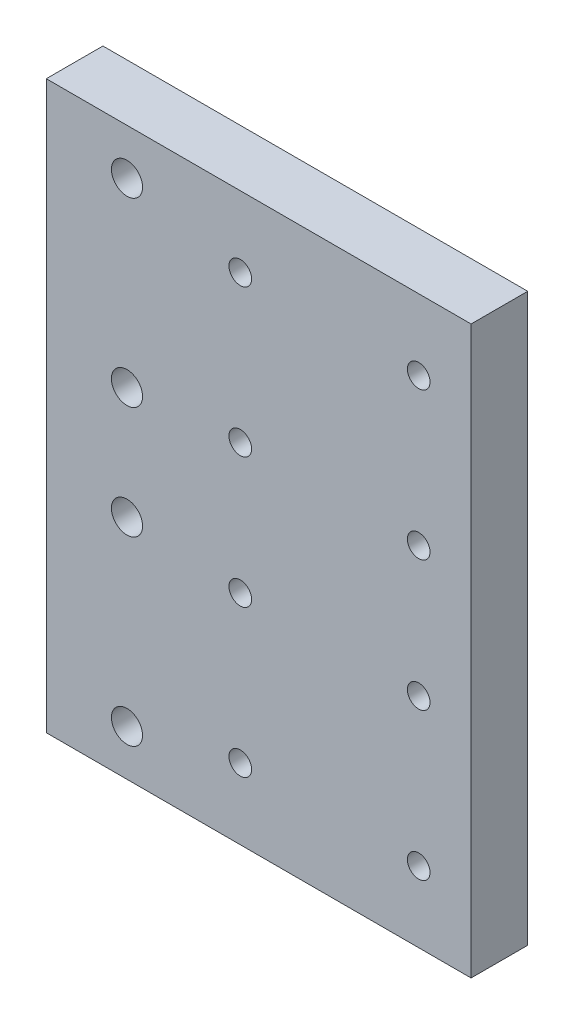
ISO-10303-21;
HEADER;
FILE_DESCRIPTION(('STEP AP214'),'2;1');
FILE_NAME('part.step','',(''),(''),'','','');
FILE_SCHEMA(('AUTOMOTIVE_DESIGN { 1 0 10303 214 1 1 1 1 }'));
ENDSEC;
DATA;
#1=APPLICATION_CONTEXT('core data for automotive mechanical design processes');
#2=APPLICATION_PROTOCOL_DEFINITION('international standard','automotive_design',2000,#1);
#3=PRODUCT_CONTEXT('',#1,'mechanical');
#4=PRODUCT('Part','Part','',(#3));
#5=PRODUCT_RELATED_PRODUCT_CATEGORY('part','',(#4));
#6=PRODUCT_DEFINITION_FORMATION('','',#4);
#7=PRODUCT_DEFINITION_CONTEXT('part definition',#1,'design');
#8=PRODUCT_DEFINITION('design','',#6,#7);
#9=PRODUCT_DEFINITION_SHAPE('','',#8);
#10=(LENGTH_UNIT() NAMED_UNIT(*) SI_UNIT(.MILLI.,.METRE.));
#11=(NAMED_UNIT(*) PLANE_ANGLE_UNIT() SI_UNIT($,.RADIAN.));
#12=(NAMED_UNIT(*) SI_UNIT($,.STERADIAN.) SOLID_ANGLE_UNIT());
#13=UNCERTAINTY_MEASURE_WITH_UNIT(LENGTH_MEASURE(1.E-05),#10,'distance_accuracy_value','');
#14=(GEOMETRIC_REPRESENTATION_CONTEXT(3) GLOBAL_UNCERTAINTY_ASSIGNED_CONTEXT((#13)) GLOBAL_UNIT_ASSIGNED_CONTEXT((#10,
#11,#12)) REPRESENTATION_CONTEXT('',''));
#15=CARTESIAN_POINT('',(0.,0.,0.));
#16=DIRECTION('',(0.,0.,1.));
#17=DIRECTION('',(1.,0.,0.));
#18=AXIS2_PLACEMENT_3D('',#15,#16,#17);
#19=CARTESIAN_POINT('',(0.,0.,10.));
#20=DIRECTION('',(0.,0.,1.));
#21=DIRECTION('',(1.,0.,0.));
#22=AXIS2_PLACEMENT_3D('',#19,#20,#21);
#23=PLANE('',#22);
#24=CARTESIAN_POINT('',(-60.75,-9.9046319920955,10.));
#25=DIRECTION('',(0.,0.,1.));
#26=DIRECTION('',(1.,0.,0.));
#27=AXIS2_PLACEMENT_3D('',#24,#25,#26);
#28=CIRCLE('',#27,2.75000000000001);
#29=CARTESIAN_POINT('',(-58.,-9.9046319920955,10.));
#30=VERTEX_POINT('',#29);
#31=EDGE_CURVE('E169',#30,#30,#28,.T.);
#32=ORIENTED_EDGE('',*,*,#31,.F.);
#33=EDGE_LOOP('',(#32));
#34=FACE_BOUND('',#33,.T.);
#35=CARTESIAN_POINT('',(-60.75,41.9046319920955,10.));
#36=DIRECTION('',(0.,0.,1.));
#37=DIRECTION('',(1.,0.,0.));
#38=AXIS2_PLACEMENT_3D('',#35,#36,#37);
#39=CIRCLE('',#38,2.75000000000001);
#40=CARTESIAN_POINT('',(-58.,41.9046319920955,10.));
#41=VERTEX_POINT('',#40);
#42=EDGE_CURVE('E157',#41,#41,#39,.T.);
#43=ORIENTED_EDGE('',*,*,#42,.F.);
#44=EDGE_LOOP('',(#43));
#45=FACE_BOUND('',#44,.T.);
#46=CARTESIAN_POINT('',(-9.25000000000001,-37.5,10.));
#47=DIRECTION('',(0.,0.,1.));
#48=DIRECTION('',(1.,0.,0.));
#49=AXIS2_PLACEMENT_3D('',#46,#47,#48);
#50=CIRCLE('',#49,2.);
#51=CARTESIAN_POINT('',(-7.25,-37.5,10.));
#52=VERTEX_POINT('',#51);
#53=EDGE_CURVE('E145',#52,#52,#50,.T.);
#54=ORIENTED_EDGE('',*,*,#53,.F.);
#55=EDGE_LOOP('',(#54));
#56=FACE_BOUND('',#55,.T.);
#57=CARTESIAN_POINT('',(-40.75,-11.5,10.));
#58=DIRECTION('',(0.,0.,1.));
#59=DIRECTION('',(1.,0.,0.));
#60=AXIS2_PLACEMENT_3D('',#57,#58,#59);
#61=CIRCLE('',#60,2.);
#62=CARTESIAN_POINT('',(-38.75,-11.5,10.));
#63=VERTEX_POINT('',#62);
#64=EDGE_CURVE('E133',#63,#63,#61,.T.);
#65=ORIENTED_EDGE('',*,*,#64,.F.);
#66=EDGE_LOOP('',(#65));
#67=FACE_BOUND('',#66,.T.);
#68=CARTESIAN_POINT('',(-40.75,11.5,10.));
#69=DIRECTION('',(0.,0.,1.));
#70=DIRECTION('',(1.,0.,0.));
#71=AXIS2_PLACEMENT_3D('',#68,#69,#70);
#72=CIRCLE('',#71,2.);
#73=CARTESIAN_POINT('',(-38.75,11.5,10.));
#74=VERTEX_POINT('',#73);
#75=EDGE_CURVE('E121',#74,#74,#72,.T.);
#76=ORIENTED_EDGE('',*,*,#75,.F.);
#77=EDGE_LOOP('',(#76));
#78=FACE_BOUND('',#77,.T.);
#79=CARTESIAN_POINT('',(-40.75,37.5,10.));
#80=DIRECTION('',(0.,0.,1.));
#81=DIRECTION('',(1.,0.,0.));
#82=AXIS2_PLACEMENT_3D('',#79,#80,#81);
#83=CIRCLE('',#82,2.);
#84=CARTESIAN_POINT('',(-38.75,37.5,10.));
#85=VERTEX_POINT('',#84);
#86=EDGE_CURVE('E100',#85,#85,#83,.T.);
#87=ORIENTED_EDGE('',*,*,#86,.F.);
#88=EDGE_LOOP('',(#87));
#89=FACE_BOUND('',#88,.T.);
#90=DIRECTION('',(-1.,0.,0.));
#91=VECTOR('',#90,1.);
#92=CARTESIAN_POINT('',(0.,50.,10.));
#93=LINE('',#92,#91);
#94=CARTESIAN_POINT('',(0.,50.,10.));
#95=VERTEX_POINT('',#94);
#96=CARTESIAN_POINT('',(-75.,50.,10.));
#97=VERTEX_POINT('',#96);
#98=EDGE_CURVE('E85',#95,#97,#93,.T.);
#99=ORIENTED_EDGE('',*,*,#98,.T.);
#100=DIRECTION('',(0.,-1.,0.));
#101=VECTOR('',#100,1.);
#102=CARTESIAN_POINT('',(-75.,50.,10.));
#103=LINE('',#102,#101);
#104=CARTESIAN_POINT('',(-75.,-50.,10.));
#105=VERTEX_POINT('',#104);
#106=EDGE_CURVE('E80',#97,#105,#103,.T.);
#107=ORIENTED_EDGE('',*,*,#106,.T.);
#108=DIRECTION('',(1.,0.,0.));
#109=VECTOR('',#108,1.);
#110=CARTESIAN_POINT('',(-75.,-50.,10.));
#111=LINE('',#110,#109);
#112=CARTESIAN_POINT('',(0.,-50.,10.));
#113=VERTEX_POINT('',#112);
#114=EDGE_CURVE('E83',#105,#113,#111,.T.);
#115=ORIENTED_EDGE('',*,*,#114,.T.);
#116=DIRECTION('',(0.,1.,0.));
#117=VECTOR('',#116,1.);
#118=CARTESIAN_POINT('',(0.,-50.,10.));
#119=LINE('',#118,#117);
#120=EDGE_CURVE('E50',#113,#95,#119,.T.);
#121=ORIENTED_EDGE('',*,*,#120,.T.);
#122=EDGE_LOOP('',(#99,#107,#115,#121));
#123=FACE_BOUND('',#122,.T.);
#124=CARTESIAN_POINT('',(-9.25000000000001,37.5,10.));
#125=DIRECTION('',(0.,0.,1.));
#126=DIRECTION('',(1.,0.,0.));
#127=AXIS2_PLACEMENT_3D('',#124,#125,#126);
#128=CIRCLE('',#127,2.);
#129=CARTESIAN_POINT('',(-7.25,37.5,10.));
#130=VERTEX_POINT('',#129);
#131=EDGE_CURVE('E115',#130,#130,#128,.T.);
#132=ORIENTED_EDGE('',*,*,#131,.F.);
#133=EDGE_LOOP('',(#132));
#134=FACE_BOUND('',#133,.T.);
#135=CARTESIAN_POINT('',(-9.25000000000001,11.5,10.));
#136=DIRECTION('',(0.,0.,1.));
#137=DIRECTION('',(1.,0.,0.));
#138=AXIS2_PLACEMENT_3D('',#135,#136,#137);
#139=CIRCLE('',#138,2.);
#140=CARTESIAN_POINT('',(-7.25000000000001,11.5,10.));
#141=VERTEX_POINT('',#140);
#142=EDGE_CURVE('E127',#141,#141,#139,.T.);
#143=ORIENTED_EDGE('',*,*,#142,.F.);
#144=EDGE_LOOP('',(#143));
#145=FACE_BOUND('',#144,.T.);
#146=CARTESIAN_POINT('',(-9.25000000000001,-11.5,10.));
#147=DIRECTION('',(0.,0.,1.));
#148=DIRECTION('',(1.,0.,0.));
#149=AXIS2_PLACEMENT_3D('',#146,#147,#148);
#150=CIRCLE('',#149,2.);
#151=CARTESIAN_POINT('',(-7.25,-11.5,10.));
#152=VERTEX_POINT('',#151);
#153=EDGE_CURVE('E139',#152,#152,#150,.T.);
#154=ORIENTED_EDGE('',*,*,#153,.F.);
#155=EDGE_LOOP('',(#154));
#156=FACE_BOUND('',#155,.T.);
#157=CARTESIAN_POINT('',(-40.75,-37.5,10.));
#158=DIRECTION('',(0.,0.,1.));
#159=DIRECTION('',(1.,0.,0.));
#160=AXIS2_PLACEMENT_3D('',#157,#158,#159);
#161=CIRCLE('',#160,2.);
#162=CARTESIAN_POINT('',(-38.75,-37.5,10.));
#163=VERTEX_POINT('',#162);
#164=EDGE_CURVE('E151',#163,#163,#161,.T.);
#165=ORIENTED_EDGE('',*,*,#164,.F.);
#166=EDGE_LOOP('',(#165));
#167=FACE_BOUND('',#166,.T.);
#168=CARTESIAN_POINT('',(-60.75,9.9046319920955,10.));
#169=DIRECTION('',(0.,0.,1.));
#170=DIRECTION('',(1.,0.,0.));
#171=AXIS2_PLACEMENT_3D('',#168,#169,#170);
#172=CIRCLE('',#171,2.75000000000001);
#173=CARTESIAN_POINT('',(-58.,9.9046319920955,10.));
#174=VERTEX_POINT('',#173);
#175=EDGE_CURVE('E163',#174,#174,#172,.T.);
#176=ORIENTED_EDGE('',*,*,#175,.F.);
#177=EDGE_LOOP('',(#176));
#178=FACE_BOUND('',#177,.T.);
#179=CARTESIAN_POINT('',(-60.75,-41.9046319920955,10.));
#180=DIRECTION('',(0.,0.,1.));
#181=DIRECTION('',(1.,0.,0.));
#182=AXIS2_PLACEMENT_3D('',#179,#180,#181);
#183=CIRCLE('',#182,2.75000000000001);
#184=CARTESIAN_POINT('',(-58.,-41.9046319920955,10.));
#185=VERTEX_POINT('',#184);
#186=EDGE_CURVE('E175',#185,#185,#183,.T.);
#187=ORIENTED_EDGE('',*,*,#186,.F.);
#188=EDGE_LOOP('',(#187));
#189=FACE_BOUND('',#188,.T.);
#190=ADVANCED_FACE('F33',(#34,#45,#56,#67,#78,#89,#123,#134,#145,#156,#167,#178,#189),#23,.T.);
#191=CARTESIAN_POINT('',(0.,0.,0.));
#192=DIRECTION('',(0.,0.,1.));
#193=DIRECTION('',(1.,0.,0.));
#194=AXIS2_PLACEMENT_3D('',#191,#192,#193);
#195=PLANE('',#194);
#196=DIRECTION('',(-1.,0.,0.));
#197=VECTOR('',#196,1.);
#198=CARTESIAN_POINT('',(0.,50.,0.));
#199=LINE('',#198,#197);
#200=CARTESIAN_POINT('',(0.,50.,0.));
#201=VERTEX_POINT('',#200);
#202=CARTESIAN_POINT('',(-75.,50.,0.));
#203=VERTEX_POINT('',#202);
#204=EDGE_CURVE('E97',#201,#203,#199,.T.);
#205=ORIENTED_EDGE('',*,*,#204,.F.);
#206=DIRECTION('',(0.,1.,0.));
#207=VECTOR('',#206,1.);
#208=CARTESIAN_POINT('',(0.,-50.,0.));
#209=LINE('',#208,#207);
#210=CARTESIAN_POINT('',(0.,-50.,0.));
#211=VERTEX_POINT('',#210);
#212=EDGE_CURVE('E73',#211,#201,#209,.T.);
#213=ORIENTED_EDGE('',*,*,#212,.F.);
#214=DIRECTION('',(1.,0.,0.));
#215=VECTOR('',#214,1.);
#216=CARTESIAN_POINT('',(-75.,-50.,0.));
#217=LINE('',#216,#215);
#218=CARTESIAN_POINT('',(-75.,-50.,0.));
#219=VERTEX_POINT('',#218);
#220=EDGE_CURVE('E67',#219,#211,#217,.T.);
#221=ORIENTED_EDGE('',*,*,#220,.F.);
#222=DIRECTION('',(0.,-1.,0.));
#223=VECTOR('',#222,1.);
#224=CARTESIAN_POINT('',(-75.,50.,0.));
#225=LINE('',#224,#223);
#226=EDGE_CURVE('E89',#203,#219,#225,.T.);
#227=ORIENTED_EDGE('',*,*,#226,.F.);
#228=EDGE_LOOP('',(#205,#213,#221,#227));
#229=FACE_BOUND('',#228,.T.);
#230=CARTESIAN_POINT('',(-40.75,37.5,0.));
#231=DIRECTION('',(0.,0.,1.));
#232=DIRECTION('',(1.,0.,0.));
#233=AXIS2_PLACEMENT_3D('',#230,#231,#232);
#234=CIRCLE('',#233,2.);
#235=CARTESIAN_POINT('',(-38.75,37.5,0.));
#236=VERTEX_POINT('',#235);
#237=EDGE_CURVE('E112',#236,#236,#234,.T.);
#238=ORIENTED_EDGE('',*,*,#237,.T.);
#239=EDGE_LOOP('',(#238));
#240=FACE_BOUND('',#239,.T.);
#241=CARTESIAN_POINT('',(-9.25000000000001,37.5,0.));
#242=DIRECTION('',(0.,0.,1.));
#243=DIRECTION('',(1.,0.,0.));
#244=AXIS2_PLACEMENT_3D('',#241,#242,#243);
#245=CIRCLE('',#244,2.);
#246=CARTESIAN_POINT('',(-7.25,37.5,0.));
#247=VERTEX_POINT('',#246);
#248=EDGE_CURVE('E118',#247,#247,#245,.T.);
#249=ORIENTED_EDGE('',*,*,#248,.T.);
#250=EDGE_LOOP('',(#249));
#251=FACE_BOUND('',#250,.T.);
#252=CARTESIAN_POINT('',(-40.75,11.5,0.));
#253=DIRECTION('',(0.,0.,1.));
#254=DIRECTION('',(1.,0.,0.));
#255=AXIS2_PLACEMENT_3D('',#252,#253,#254);
#256=CIRCLE('',#255,2.);
#257=CARTESIAN_POINT('',(-38.75,11.5,0.));
#258=VERTEX_POINT('',#257);
#259=EDGE_CURVE('E124',#258,#258,#256,.T.);
#260=ORIENTED_EDGE('',*,*,#259,.T.);
#261=EDGE_LOOP('',(#260));
#262=FACE_BOUND('',#261,.T.);
#263=CARTESIAN_POINT('',(-9.25000000000001,11.5,0.));
#264=DIRECTION('',(0.,0.,1.));
#265=DIRECTION('',(1.,0.,0.));
#266=AXIS2_PLACEMENT_3D('',#263,#264,#265);
#267=CIRCLE('',#266,2.);
#268=CARTESIAN_POINT('',(-7.25000000000001,11.5,0.));
#269=VERTEX_POINT('',#268);
#270=EDGE_CURVE('E130',#269,#269,#267,.T.);
#271=ORIENTED_EDGE('',*,*,#270,.T.);
#272=EDGE_LOOP('',(#271));
#273=FACE_BOUND('',#272,.T.);
#274=CARTESIAN_POINT('',(-40.75,-11.5,0.));
#275=DIRECTION('',(0.,0.,1.));
#276=DIRECTION('',(1.,0.,0.));
#277=AXIS2_PLACEMENT_3D('',#274,#275,#276);
#278=CIRCLE('',#277,2.);
#279=CARTESIAN_POINT('',(-38.75,-11.5,0.));
#280=VERTEX_POINT('',#279);
#281=EDGE_CURVE('E136',#280,#280,#278,.T.);
#282=ORIENTED_EDGE('',*,*,#281,.T.);
#283=EDGE_LOOP('',(#282));
#284=FACE_BOUND('',#283,.T.);
#285=CARTESIAN_POINT('',(-9.25000000000001,-11.5,0.));
#286=DIRECTION('',(0.,0.,1.));
#287=DIRECTION('',(1.,0.,0.));
#288=AXIS2_PLACEMENT_3D('',#285,#286,#287);
#289=CIRCLE('',#288,2.);
#290=CARTESIAN_POINT('',(-7.25,-11.5,0.));
#291=VERTEX_POINT('',#290);
#292=EDGE_CURVE('E142',#291,#291,#289,.T.);
#293=ORIENTED_EDGE('',*,*,#292,.T.);
#294=EDGE_LOOP('',(#293));
#295=FACE_BOUND('',#294,.T.);
#296=CARTESIAN_POINT('',(-9.25000000000001,-37.5,0.));
#297=DIRECTION('',(0.,0.,1.));
#298=DIRECTION('',(1.,0.,0.));
#299=AXIS2_PLACEMENT_3D('',#296,#297,#298);
#300=CIRCLE('',#299,2.);
#301=CARTESIAN_POINT('',(-7.25,-37.5,0.));
#302=VERTEX_POINT('',#301);
#303=EDGE_CURVE('E148',#302,#302,#300,.T.);
#304=ORIENTED_EDGE('',*,*,#303,.T.);
#305=EDGE_LOOP('',(#304));
#306=FACE_BOUND('',#305,.T.);
#307=CARTESIAN_POINT('',(-40.75,-37.5,0.));
#308=DIRECTION('',(0.,0.,1.));
#309=DIRECTION('',(1.,0.,0.));
#310=AXIS2_PLACEMENT_3D('',#307,#308,#309);
#311=CIRCLE('',#310,2.);
#312=CARTESIAN_POINT('',(-38.75,-37.5,0.));
#313=VERTEX_POINT('',#312);
#314=EDGE_CURVE('E154',#313,#313,#311,.T.);
#315=ORIENTED_EDGE('',*,*,#314,.T.);
#316=EDGE_LOOP('',(#315));
#317=FACE_BOUND('',#316,.T.);
#318=CARTESIAN_POINT('',(-60.75,41.9046319920955,0.));
#319=DIRECTION('',(0.,0.,1.));
#320=DIRECTION('',(1.,0.,0.));
#321=AXIS2_PLACEMENT_3D('',#318,#319,#320);
#322=CIRCLE('',#321,2.75000000000001);
#323=CARTESIAN_POINT('',(-58.,41.9046319920955,0.));
#324=VERTEX_POINT('',#323);
#325=EDGE_CURVE('E160',#324,#324,#322,.T.);
#326=ORIENTED_EDGE('',*,*,#325,.T.);
#327=EDGE_LOOP('',(#326));
#328=FACE_BOUND('',#327,.T.);
#329=CARTESIAN_POINT('',(-60.75,9.9046319920955,0.));
#330=DIRECTION('',(0.,0.,1.));
#331=DIRECTION('',(1.,0.,0.));
#332=AXIS2_PLACEMENT_3D('',#329,#330,#331);
#333=CIRCLE('',#332,2.75000000000001);
#334=CARTESIAN_POINT('',(-58.,9.9046319920955,0.));
#335=VERTEX_POINT('',#334);
#336=EDGE_CURVE('E166',#335,#335,#333,.T.);
#337=ORIENTED_EDGE('',*,*,#336,.T.);
#338=EDGE_LOOP('',(#337));
#339=FACE_BOUND('',#338,.T.);
#340=CARTESIAN_POINT('',(-60.75,-9.9046319920955,0.));
#341=DIRECTION('',(0.,0.,1.));
#342=DIRECTION('',(1.,0.,0.));
#343=AXIS2_PLACEMENT_3D('',#340,#341,#342);
#344=CIRCLE('',#343,2.75000000000001);
#345=CARTESIAN_POINT('',(-58.,-9.9046319920955,0.));
#346=VERTEX_POINT('',#345);
#347=EDGE_CURVE('E172',#346,#346,#344,.T.);
#348=ORIENTED_EDGE('',*,*,#347,.T.);
#349=EDGE_LOOP('',(#348));
#350=FACE_BOUND('',#349,.T.);
#351=CARTESIAN_POINT('',(-60.75,-41.9046319920955,0.));
#352=DIRECTION('',(0.,0.,1.));
#353=DIRECTION('',(1.,0.,0.));
#354=AXIS2_PLACEMENT_3D('',#351,#352,#353);
#355=CIRCLE('',#354,2.75000000000001);
#356=CARTESIAN_POINT('',(-58.,-41.9046319920955,0.));
#357=VERTEX_POINT('',#356);
#358=EDGE_CURVE('E178',#357,#357,#355,.T.);
#359=ORIENTED_EDGE('',*,*,#358,.T.);
#360=EDGE_LOOP('',(#359));
#361=FACE_BOUND('',#360,.T.);
#362=ADVANCED_FACE('F108',(#229,#240,#251,#262,#273,#284,#295,#306,#317,#328,#339,#350,#361),
#195,.F.);
#363=CARTESIAN_POINT('',(0.,50.,10.));
#364=DIRECTION('',(0.,-1.,0.));
#365=DIRECTION('',(0.,0.,-1.));
#366=AXIS2_PLACEMENT_3D('',#363,#364,#365);
#367=PLANE('',#366);
#368=ORIENTED_EDGE('',*,*,#204,.T.);
#369=DIRECTION('',(0.,0.,-1.));
#370=VECTOR('',#369,1.);
#371=CARTESIAN_POINT('',(-75.,50.,10.));
#372=LINE('',#371,#370);
#373=EDGE_CURVE('E11',#97,#203,#372,.T.);
#374=ORIENTED_EDGE('',*,*,#373,.F.);
#375=ORIENTED_EDGE('',*,*,#98,.F.);
#376=DIRECTION('',(0.,0.,-1.));
#377=VECTOR('',#376,1.);
#378=CARTESIAN_POINT('',(0.,50.,10.));
#379=LINE('',#378,#377);
#380=EDGE_CURVE('E93',#95,#201,#379,.T.);
#381=ORIENTED_EDGE('',*,*,#380,.T.);
#382=EDGE_LOOP('',(#368,#374,#375,#381));
#383=FACE_BOUND('',#382,.T.);
#384=ADVANCED_FACE('F35',(#383),#367,.F.);
#385=CARTESIAN_POINT('',(-75.,50.,10.));
#386=DIRECTION('',(1.,0.,0.));
#387=DIRECTION('',(0.,0.,-1.));
#388=AXIS2_PLACEMENT_3D('',#385,#386,#387);
#389=PLANE('',#388);
#390=ORIENTED_EDGE('',*,*,#226,.T.);
#391=DIRECTION('',(0.,0.,-1.));
#392=VECTOR('',#391,1.);
#393=CARTESIAN_POINT('',(-75.,-50.,10.));
#394=LINE('',#393,#392);
#395=EDGE_CURVE('E42',#105,#219,#394,.T.);
#396=ORIENTED_EDGE('',*,*,#395,.F.);
#397=ORIENTED_EDGE('',*,*,#106,.F.);
#398=ORIENTED_EDGE('',*,*,#373,.T.);
#399=EDGE_LOOP('',(#390,#396,#397,#398));
#400=FACE_BOUND('',#399,.T.);
#401=ADVANCED_FACE('F88',(#400),#389,.F.);
#402=CARTESIAN_POINT('',(-75.,-50.,10.));
#403=DIRECTION('',(0.,1.,0.));
#404=DIRECTION('',(0.,0.,1.));
#405=AXIS2_PLACEMENT_3D('',#402,#403,#404);
#406=PLANE('',#405);
#407=ORIENTED_EDGE('',*,*,#220,.T.);
#408=DIRECTION('',(0.,0.,-1.));
#409=VECTOR('',#408,1.);
#410=CARTESIAN_POINT('',(0.,-50.,10.));
#411=LINE('',#410,#409);
#412=EDGE_CURVE('E90',#113,#211,#411,.T.);
#413=ORIENTED_EDGE('',*,*,#412,.F.);
#414=ORIENTED_EDGE('',*,*,#114,.F.);
#415=ORIENTED_EDGE('',*,*,#395,.T.);
#416=EDGE_LOOP('',(#407,#413,#414,#415));
#417=FACE_BOUND('',#416,.T.);
#418=ADVANCED_FACE('F91',(#417),#406,.F.);
#419=CARTESIAN_POINT('',(0.,-50.,10.));
#420=DIRECTION('',(-1.,0.,0.));
#421=DIRECTION('',(0.,0.,1.));
#422=AXIS2_PLACEMENT_3D('',#419,#420,#421);
#423=PLANE('',#422);
#424=ORIENTED_EDGE('',*,*,#212,.T.);
#425=ORIENTED_EDGE('',*,*,#380,.F.);
#426=ORIENTED_EDGE('',*,*,#120,.F.);
#427=ORIENTED_EDGE('',*,*,#412,.T.);
#428=EDGE_LOOP('',(#424,#425,#426,#427));
#429=FACE_BOUND('',#428,.T.);
#430=ADVANCED_FACE('F105',(#429),#423,.F.);
#431=CARTESIAN_POINT('',(-40.75,37.5,10.));
#432=DIRECTION('',(0.,0.,-1.));
#433=DIRECTION('',(-1.,0.,0.));
#434=AXIS2_PLACEMENT_3D('',#431,#432,#433);
#435=CYLINDRICAL_SURFACE('',#434,2.);
#436=ORIENTED_EDGE('',*,*,#86,.T.);
#437=EDGE_LOOP('',(#436));
#438=FACE_BOUND('',#437,.T.);
#439=ORIENTED_EDGE('',*,*,#237,.F.);
#440=EDGE_LOOP('',(#439));
#441=FACE_BOUND('',#440,.T.);
#442=ADVANCED_FACE('F197',(#438,#441),#435,.F.);
#443=CARTESIAN_POINT('',(-9.25000000000001,37.5,10.));
#444=DIRECTION('',(0.,0.,-1.));
#445=DIRECTION('',(-1.,0.,0.));
#446=AXIS2_PLACEMENT_3D('',#443,#444,#445);
#447=CYLINDRICAL_SURFACE('',#446,2.);
#448=ORIENTED_EDGE('',*,*,#131,.T.);
#449=EDGE_LOOP('',(#448));
#450=FACE_BOUND('',#449,.T.);
#451=ORIENTED_EDGE('',*,*,#248,.F.);
#452=EDGE_LOOP('',(#451));
#453=FACE_BOUND('',#452,.T.);
#454=ADVANCED_FACE('F243',(#450,#453),#447,.F.);
#455=CARTESIAN_POINT('',(-40.75,11.5,10.));
#456=DIRECTION('',(0.,0.,-1.));
#457=DIRECTION('',(-1.,0.,0.));
#458=AXIS2_PLACEMENT_3D('',#455,#456,#457);
#459=CYLINDRICAL_SURFACE('',#458,2.);
#460=ORIENTED_EDGE('',*,*,#75,.T.);
#461=EDGE_LOOP('',(#460));
#462=FACE_BOUND('',#461,.T.);
#463=ORIENTED_EDGE('',*,*,#259,.F.);
#464=EDGE_LOOP('',(#463));
#465=FACE_BOUND('',#464,.T.);
#466=ADVANCED_FACE('F251',(#462,#465),#459,.F.);
#467=CARTESIAN_POINT('',(-9.25000000000001,11.5,10.));
#468=DIRECTION('',(0.,0.,-1.));
#469=DIRECTION('',(-1.,0.,0.));
#470=AXIS2_PLACEMENT_3D('',#467,#468,#469);
#471=CYLINDRICAL_SURFACE('',#470,2.);
#472=ORIENTED_EDGE('',*,*,#142,.T.);
#473=EDGE_LOOP('',(#472));
#474=FACE_BOUND('',#473,.T.);
#475=ORIENTED_EDGE('',*,*,#270,.F.);
#476=EDGE_LOOP('',(#475));
#477=FACE_BOUND('',#476,.T.);
#478=ADVANCED_FACE('F259',(#474,#477),#471,.F.);
#479=CARTESIAN_POINT('',(-40.75,-11.5,10.));
#480=DIRECTION('',(0.,0.,-1.));
#481=DIRECTION('',(-1.,0.,0.));
#482=AXIS2_PLACEMENT_3D('',#479,#480,#481);
#483=CYLINDRICAL_SURFACE('',#482,2.);
#484=ORIENTED_EDGE('',*,*,#64,.T.);
#485=EDGE_LOOP('',(#484));
#486=FACE_BOUND('',#485,.T.);
#487=ORIENTED_EDGE('',*,*,#281,.F.);
#488=EDGE_LOOP('',(#487));
#489=FACE_BOUND('',#488,.T.);
#490=ADVANCED_FACE('F268',(#486,#489),#483,.F.);
#491=CARTESIAN_POINT('',(-9.25000000000001,-11.5,10.));
#492=DIRECTION('',(0.,0.,-1.));
#493=DIRECTION('',(-1.,0.,0.));
#494=AXIS2_PLACEMENT_3D('',#491,#492,#493);
#495=CYLINDRICAL_SURFACE('',#494,2.);
#496=ORIENTED_EDGE('',*,*,#153,.T.);
#497=EDGE_LOOP('',(#496));
#498=FACE_BOUND('',#497,.T.);
#499=ORIENTED_EDGE('',*,*,#292,.F.);
#500=EDGE_LOOP('',(#499));
#501=FACE_BOUND('',#500,.T.);
#502=ADVANCED_FACE('F277',(#498,#501),#495,.F.);
#503=CARTESIAN_POINT('',(-9.25000000000001,-37.5,10.));
#504=DIRECTION('',(0.,0.,-1.));
#505=DIRECTION('',(-1.,0.,0.));
#506=AXIS2_PLACEMENT_3D('',#503,#504,#505);
#507=CYLINDRICAL_SURFACE('',#506,2.);
#508=ORIENTED_EDGE('',*,*,#53,.T.);
#509=EDGE_LOOP('',(#508));
#510=FACE_BOUND('',#509,.T.);
#511=ORIENTED_EDGE('',*,*,#303,.F.);
#512=EDGE_LOOP('',(#511));
#513=FACE_BOUND('',#512,.T.);
#514=ADVANCED_FACE('F286',(#510,#513),#507,.F.);
#515=CARTESIAN_POINT('',(-40.75,-37.5,10.));
#516=DIRECTION('',(0.,0.,-1.));
#517=DIRECTION('',(-1.,0.,0.));
#518=AXIS2_PLACEMENT_3D('',#515,#516,#517);
#519=CYLINDRICAL_SURFACE('',#518,2.);
#520=ORIENTED_EDGE('',*,*,#164,.T.);
#521=EDGE_LOOP('',(#520));
#522=FACE_BOUND('',#521,.T.);
#523=ORIENTED_EDGE('',*,*,#314,.F.);
#524=EDGE_LOOP('',(#523));
#525=FACE_BOUND('',#524,.T.);
#526=ADVANCED_FACE('F295',(#522,#525),#519,.F.);
#527=CARTESIAN_POINT('',(-60.75,41.9046319920955,10.));
#528=DIRECTION('',(0.,0.,-1.));
#529=DIRECTION('',(-1.,0.,0.));
#530=AXIS2_PLACEMENT_3D('',#527,#528,#529);
#531=CYLINDRICAL_SURFACE('',#530,2.75000000000001);
#532=ORIENTED_EDGE('',*,*,#42,.T.);
#533=EDGE_LOOP('',(#532));
#534=FACE_BOUND('',#533,.T.);
#535=ORIENTED_EDGE('',*,*,#325,.F.);
#536=EDGE_LOOP('',(#535));
#537=FACE_BOUND('',#536,.T.);
#538=ADVANCED_FACE('F304',(#534,#537),#531,.F.);
#539=CARTESIAN_POINT('',(-60.75,9.9046319920955,10.));
#540=DIRECTION('',(0.,0.,-1.));
#541=DIRECTION('',(-1.,0.,0.));
#542=AXIS2_PLACEMENT_3D('',#539,#540,#541);
#543=CYLINDRICAL_SURFACE('',#542,2.75000000000001);
#544=ORIENTED_EDGE('',*,*,#175,.T.);
#545=EDGE_LOOP('',(#544));
#546=FACE_BOUND('',#545,.T.);
#547=ORIENTED_EDGE('',*,*,#336,.F.);
#548=EDGE_LOOP('',(#547));
#549=FACE_BOUND('',#548,.T.);
#550=ADVANCED_FACE('F313',(#546,#549),#543,.F.);
#551=CARTESIAN_POINT('',(-60.75,-9.9046319920955,10.));
#552=DIRECTION('',(0.,0.,-1.));
#553=DIRECTION('',(-1.,0.,0.));
#554=AXIS2_PLACEMENT_3D('',#551,#552,#553);
#555=CYLINDRICAL_SURFACE('',#554,2.75000000000001);
#556=ORIENTED_EDGE('',*,*,#31,.T.);
#557=EDGE_LOOP('',(#556));
#558=FACE_BOUND('',#557,.T.);
#559=ORIENTED_EDGE('',*,*,#347,.F.);
#560=EDGE_LOOP('',(#559));
#561=FACE_BOUND('',#560,.T.);
#562=ADVANCED_FACE('F322',(#558,#561),#555,.F.);
#563=CARTESIAN_POINT('',(-60.75,-41.9046319920955,10.));
#564=DIRECTION('',(0.,0.,-1.));
#565=DIRECTION('',(-1.,0.,0.));
#566=AXIS2_PLACEMENT_3D('',#563,#564,#565);
#567=CYLINDRICAL_SURFACE('',#566,2.75000000000001);
#568=ORIENTED_EDGE('',*,*,#186,.T.);
#569=EDGE_LOOP('',(#568));
#570=FACE_BOUND('',#569,.T.);
#571=ORIENTED_EDGE('',*,*,#358,.F.);
#572=EDGE_LOOP('',(#571));
#573=FACE_BOUND('',#572,.T.);
#574=ADVANCED_FACE('F184',(#570,#573),#567,.F.);
#575=CLOSED_SHELL('',(#190,#362,#384,#401,#418,#430,#442,#454,#466,#478,#490,#502,#514,#526,
#538,#550,#562,#574));
#576=MANIFOLD_SOLID_BREP('B2',#575);
#577=ADVANCED_BREP_SHAPE_REPRESENTATION('',(#18,#576),#14);
#578=SHAPE_DEFINITION_REPRESENTATION(#9,#577);
ENDSEC;
END-ISO-10303-21;
